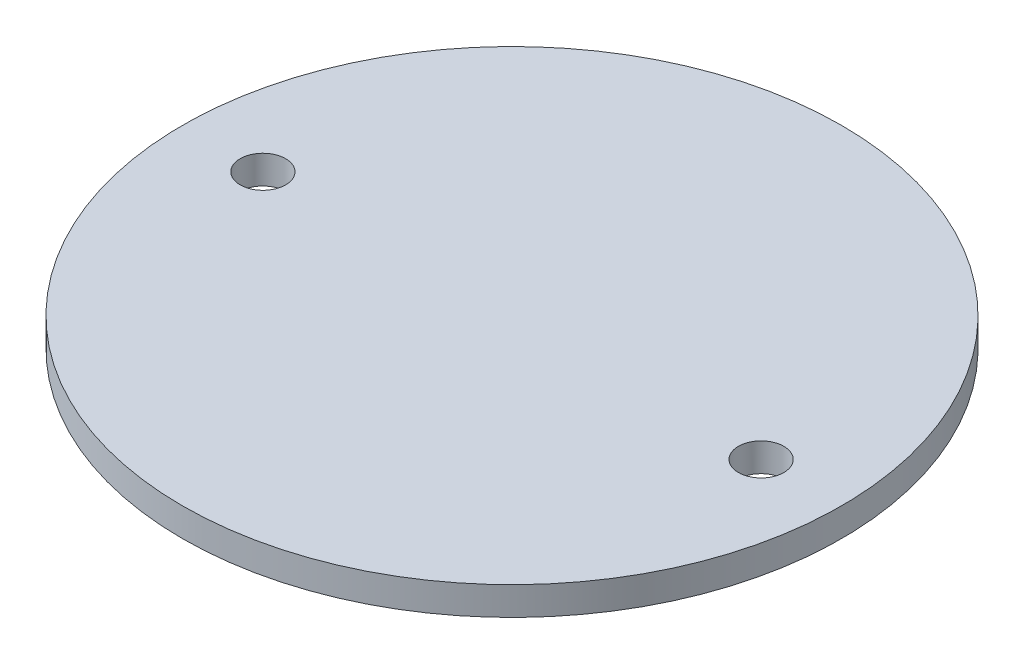
ISO-10303-21;
HEADER;
FILE_DESCRIPTION(('STEP AP214'),'2;1');
FILE_NAME('part.step','',(''),(''),'','','');
FILE_SCHEMA(('AUTOMOTIVE_DESIGN { 1 0 10303 214 1 1 1 1 }'));
ENDSEC;
DATA;
#1=APPLICATION_CONTEXT('core data for automotive mechanical design processes');
#2=APPLICATION_PROTOCOL_DEFINITION('international standard','automotive_design',2000,#1);
#3=PRODUCT_CONTEXT('',#1,'mechanical');
#4=PRODUCT('Part','Part','',(#3));
#5=PRODUCT_RELATED_PRODUCT_CATEGORY('part','',(#4));
#6=PRODUCT_DEFINITION_FORMATION('','',#4);
#7=PRODUCT_DEFINITION_CONTEXT('part definition',#1,'design');
#8=PRODUCT_DEFINITION('design','',#6,#7);
#9=PRODUCT_DEFINITION_SHAPE('','',#8);
#10=(LENGTH_UNIT() NAMED_UNIT(*) SI_UNIT(.MILLI.,.METRE.));
#11=(NAMED_UNIT(*) PLANE_ANGLE_UNIT() SI_UNIT($,.RADIAN.));
#12=(NAMED_UNIT(*) SI_UNIT($,.STERADIAN.) SOLID_ANGLE_UNIT());
#13=UNCERTAINTY_MEASURE_WITH_UNIT(LENGTH_MEASURE(1.E-05),#10,'distance_accuracy_value','');
#14=(GEOMETRIC_REPRESENTATION_CONTEXT(3) GLOBAL_UNCERTAINTY_ASSIGNED_CONTEXT((#13)) GLOBAL_UNIT_ASSIGNED_CONTEXT((#10,
#11,#12)) REPRESENTATION_CONTEXT('',''));
#15=CARTESIAN_POINT('',(0.,0.,0.));
#16=DIRECTION('',(0.,0.,1.));
#17=DIRECTION('',(1.,0.,0.));
#18=AXIS2_PLACEMENT_3D('',#15,#16,#17);
#19=CARTESIAN_POINT('',(0.,6.35,0.));
#20=DIRECTION('',(0.,-1.,0.));
#21=DIRECTION('',(0.,0.,-1.));
#22=AXIS2_PLACEMENT_3D('',#19,#20,#21);
#23=CYLINDRICAL_SURFACE('',#22,73.66);
#24=CARTESIAN_POINT('',(0.,6.35,0.));
#25=DIRECTION('',(0.,1.,0.));
#26=DIRECTION('',(0.,0.,1.));
#27=AXIS2_PLACEMENT_3D('',#24,#25,#26);
#28=CIRCLE('',#27,73.66);
#29=CARTESIAN_POINT('',(0.,6.35,73.66));
#30=VERTEX_POINT('',#29);
#31=EDGE_CURVE('E10',#30,#30,#28,.T.);
#32=ORIENTED_EDGE('',*,*,#31,.F.);
#33=EDGE_LOOP('',(#32));
#34=FACE_BOUND('',#33,.T.);
#35=CARTESIAN_POINT('',(0.,0.,0.));
#36=DIRECTION('',(0.,1.,0.));
#37=DIRECTION('',(0.,0.,1.));
#38=AXIS2_PLACEMENT_3D('',#35,#36,#37);
#39=CIRCLE('',#38,73.66);
#40=CARTESIAN_POINT('',(0.,0.,73.66));
#41=VERTEX_POINT('',#40);
#42=EDGE_CURVE('E44',#41,#41,#39,.T.);
#43=ORIENTED_EDGE('',*,*,#42,.T.);
#44=EDGE_LOOP('',(#43));
#45=FACE_BOUND('',#44,.T.);
#46=ADVANCED_FACE('F37',(#34,#45),#23,.T.);
#47=CARTESIAN_POINT('',(0.,6.35,0.));
#48=DIRECTION('',(0.,1.,0.));
#49=DIRECTION('',(0.,0.,1.));
#50=AXIS2_PLACEMENT_3D('',#47,#48,#49);
#51=PLANE('',#50);
#52=CARTESIAN_POINT('',(-55.6786744400088,6.35,0.));
#53=DIRECTION('',(0.,1.,0.));
#54=DIRECTION('',(0.,0.,1.));
#55=AXIS2_PLACEMENT_3D('',#52,#53,#54);
#56=CIRCLE('',#55,5.08);
#57=CARTESIAN_POINT('',(-55.6786744400088,6.35,5.08));
#58=VERTEX_POINT('',#57);
#59=EDGE_CURVE('E55',#58,#58,#56,.T.);
#60=ORIENTED_EDGE('',*,*,#59,.F.);
#61=EDGE_LOOP('',(#60));
#62=FACE_BOUND('',#61,.T.);
#63=CARTESIAN_POINT('',(55.6786744400088,6.35,0.));
#64=DIRECTION('',(0.,1.,0.));
#65=DIRECTION('',(0.,0.,-1.));
#66=AXIS2_PLACEMENT_3D('',#63,#64,#65);
#67=CIRCLE('',#66,5.08);
#68=CARTESIAN_POINT('',(55.6786744400088,6.35,-5.08));
#69=VERTEX_POINT('',#68);
#70=EDGE_CURVE('E51',#69,#69,#67,.T.);
#71=ORIENTED_EDGE('',*,*,#70,.F.);
#72=EDGE_LOOP('',(#71));
#73=FACE_BOUND('',#72,.T.);
#74=ORIENTED_EDGE('',*,*,#31,.T.);
#75=EDGE_LOOP('',(#74));
#76=FACE_BOUND('',#75,.T.);
#77=ADVANCED_FACE('F68',(#62,#73,#76),#51,.T.);
#78=CARTESIAN_POINT('',(0.,0.,0.));
#79=DIRECTION('',(0.,1.,0.));
#80=DIRECTION('',(0.,0.,1.));
#81=AXIS2_PLACEMENT_3D('',#78,#79,#80);
#82=PLANE('',#81);
#83=CARTESIAN_POINT('',(-55.6786744400088,0.,0.));
#84=DIRECTION('',(0.,1.,0.));
#85=DIRECTION('',(0.,0.,1.));
#86=AXIS2_PLACEMENT_3D('',#83,#84,#85);
#87=CIRCLE('',#86,5.08);
#88=CARTESIAN_POINT('',(-55.6786744400088,0.,5.08));
#89=VERTEX_POINT('',#88);
#90=EDGE_CURVE('E40',#89,#89,#87,.T.);
#91=ORIENTED_EDGE('',*,*,#90,.T.);
#92=EDGE_LOOP('',(#91));
#93=FACE_BOUND('',#92,.T.);
#94=CARTESIAN_POINT('',(55.6786744400088,0.,0.));
#95=DIRECTION('',(0.,1.,0.));
#96=DIRECTION('',(0.,0.,1.));
#97=AXIS2_PLACEMENT_3D('',#94,#95,#96);
#98=CIRCLE('',#97,5.08);
#99=CARTESIAN_POINT('',(55.6786744400088,0.,5.08));
#100=VERTEX_POINT('',#99);
#101=EDGE_CURVE('E53',#100,#100,#98,.T.);
#102=ORIENTED_EDGE('',*,*,#101,.T.);
#103=EDGE_LOOP('',(#102));
#104=FACE_BOUND('',#103,.T.);
#105=ORIENTED_EDGE('',*,*,#42,.F.);
#106=EDGE_LOOP('',(#105));
#107=FACE_BOUND('',#106,.T.);
#108=ADVANCED_FACE('F70',(#93,#104,#107),#82,.F.);
#109=CARTESIAN_POINT('',(55.6786744400088,-1.2E-05,0.));
#110=DIRECTION('',(0.,1.,0.));
#111=DIRECTION('',(0.,0.,1.));
#112=AXIS2_PLACEMENT_3D('',#109,#110,#111);
#113=CYLINDRICAL_SURFACE('',#112,5.08);
#114=ORIENTED_EDGE('',*,*,#70,.T.);
#115=EDGE_LOOP('',(#114));
#116=FACE_BOUND('',#115,.T.);
#117=ORIENTED_EDGE('',*,*,#101,.F.);
#118=EDGE_LOOP('',(#117));
#119=FACE_BOUND('',#118,.T.);
#120=ADVANCED_FACE('F65',(#116,#119),#113,.F.);
#121=CARTESIAN_POINT('',(-55.6786744400088,-1.2E-05,0.));
#122=DIRECTION('',(0.,1.,0.));
#123=DIRECTION('',(0.,0.,1.));
#124=AXIS2_PLACEMENT_3D('',#121,#122,#123);
#125=CYLINDRICAL_SURFACE('',#124,5.08);
#126=ORIENTED_EDGE('',*,*,#59,.T.);
#127=EDGE_LOOP('',(#126));
#128=FACE_BOUND('',#127,.T.);
#129=ORIENTED_EDGE('',*,*,#90,.F.);
#130=EDGE_LOOP('',(#129));
#131=FACE_BOUND('',#130,.T.);
#132=ADVANCED_FACE('F82',(#128,#131),#125,.F.);
#133=CLOSED_SHELL('',(#46,#77,#108,#120,#132));
#134=MANIFOLD_SOLID_BREP('B2',#133);
#135=ADVANCED_BREP_SHAPE_REPRESENTATION('',(#18,#134),#14);
#136=SHAPE_DEFINITION_REPRESENTATION(#9,#135);
ENDSEC;
END-ISO-10303-21;
